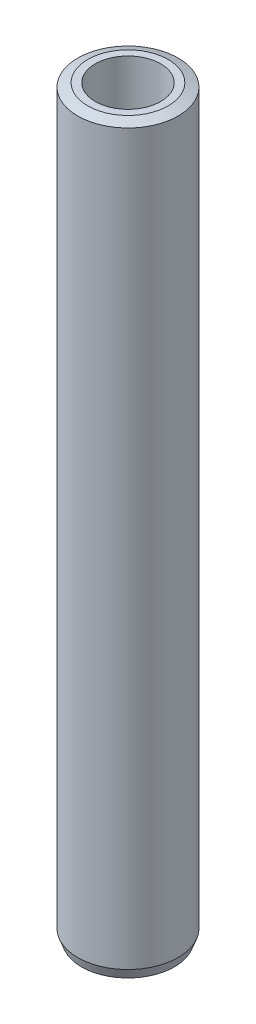
ISO-10303-21;
HEADER;
FILE_DESCRIPTION(('STEP AP214'),'2;1');
FILE_NAME('part.step','',(''),(''),'','','');
FILE_SCHEMA(('AUTOMOTIVE_DESIGN { 1 0 10303 214 1 1 1 1 }'));
ENDSEC;
DATA;
#1=APPLICATION_CONTEXT('core data for automotive mechanical design processes');
#2=APPLICATION_PROTOCOL_DEFINITION('international standard','automotive_design',2000,#1);
#3=PRODUCT_CONTEXT('',#1,'mechanical');
#4=PRODUCT('Part','Part','',(#3));
#5=PRODUCT_RELATED_PRODUCT_CATEGORY('part','',(#4));
#6=PRODUCT_DEFINITION_FORMATION('','',#4);
#7=PRODUCT_DEFINITION_CONTEXT('part definition',#1,'design');
#8=PRODUCT_DEFINITION('design','',#6,#7);
#9=PRODUCT_DEFINITION_SHAPE('','',#8);
#10=(LENGTH_UNIT() NAMED_UNIT(*) SI_UNIT(.MILLI.,.METRE.));
#11=(NAMED_UNIT(*) PLANE_ANGLE_UNIT() SI_UNIT($,.RADIAN.));
#12=(NAMED_UNIT(*) SI_UNIT($,.STERADIAN.) SOLID_ANGLE_UNIT());
#13=UNCERTAINTY_MEASURE_WITH_UNIT(LENGTH_MEASURE(1.E-05),#10,'distance_accuracy_value','');
#14=(GEOMETRIC_REPRESENTATION_CONTEXT(3) GLOBAL_UNCERTAINTY_ASSIGNED_CONTEXT((#13)) GLOBAL_UNIT_ASSIGNED_CONTEXT((#10,
#11,#12)) REPRESENTATION_CONTEXT('',''));
#15=CARTESIAN_POINT('',(0.,0.,0.));
#16=DIRECTION('',(0.,0.,1.));
#17=DIRECTION('',(1.,0.,0.));
#18=AXIS2_PLACEMENT_3D('',#15,#16,#17);
#19=CARTESIAN_POINT('',(0.,184.789062151889,0.));
#20=DIRECTION('',(0.,-1.,0.));
#21=DIRECTION('',(0.,0.,-1.));
#22=AXIS2_PLACEMENT_3D('',#19,#20,#21);
#23=CYLINDRICAL_SURFACE('',#22,12.5);
#24=CARTESIAN_POINT('',(0.,183.853214608277,0.));
#25=DIRECTION('',(0.,1.,0.));
#26=DIRECTION('',(0.,0.,1.));
#27=AXIS2_PLACEMENT_3D('',#24,#25,#26);
#28=CIRCLE('',#27,12.5);
#29=CARTESIAN_POINT('',(0.,183.853214608277,12.5));
#30=VERTEX_POINT('',#29);
#31=EDGE_CURVE('E50',#30,#30,#28,.F.);
#32=ORIENTED_EDGE('',*,*,#31,.T.);
#33=EDGE_LOOP('',(#32));
#34=FACE_BOUND('',#33,.T.);
#35=CARTESIAN_POINT('',(0.,2.49135703973449,0.));
#36=DIRECTION('',(0.,1.,0.));
#37=DIRECTION('',(0.,0.,1.));
#38=AXIS2_PLACEMENT_3D('',#35,#36,#37);
#39=CIRCLE('',#38,12.5);
#40=CARTESIAN_POINT('',(0.,2.49135703973449,12.5));
#41=VERTEX_POINT('',#40);
#42=EDGE_CURVE('E51',#41,#41,#39,.T.);
#43=ORIENTED_EDGE('',*,*,#42,.T.);
#44=EDGE_LOOP('',(#43));
#45=FACE_BOUND('',#44,.T.);
#46=ADVANCED_FACE('F39',(#34,#45),#23,.T.);
#47=CARTESIAN_POINT('',(0.,184.789062151889,0.));
#48=DIRECTION('',(0.,1.,0.));
#49=DIRECTION('',(0.,0.,1.));
#50=AXIS2_PLACEMENT_3D('',#47,#48,#49);
#51=PLANE('',#50);
#52=CARTESIAN_POINT('',(0.,184.789062151889,0.));
#53=DIRECTION('',(0.,1.,0.));
#54=DIRECTION('',(0.,0.,1.));
#55=AXIS2_PLACEMENT_3D('',#52,#53,#54);
#56=CIRCLE('',#55,10.0086429602656);
#57=CARTESIAN_POINT('',(0.,184.789062151889,10.0086429602656));
#58=VERTEX_POINT('',#57);
#59=EDGE_CURVE('E54',#58,#58,#56,.T.);
#60=ORIENTED_EDGE('',*,*,#59,.T.);
#61=EDGE_LOOP('',(#60));
#62=FACE_BOUND('',#61,.T.);
#63=CARTESIAN_POINT('',(0.,184.789062151889,0.));
#64=DIRECTION('',(0.,1.,0.));
#65=DIRECTION('',(0.,0.,1.));
#66=AXIS2_PLACEMENT_3D('',#63,#64,#65);
#67=CIRCLE('',#66,8.13970595904328);
#68=CARTESIAN_POINT('',(0.,184.789062151889,8.13970595904328));
#69=VERTEX_POINT('',#68);
#70=EDGE_CURVE('E58',#69,#69,#67,.T.);
#71=ORIENTED_EDGE('',*,*,#70,.F.);
#72=EDGE_LOOP('',(#71));
#73=FACE_BOUND('',#72,.T.);
#74=ADVANCED_FACE('F69',(#62,#73),#51,.T.);
#75=CARTESIAN_POINT('',(0.,0.,0.));
#76=DIRECTION('',(0.,1.,0.));
#77=DIRECTION('',(0.,0.,1.));
#78=AXIS2_PLACEMENT_3D('',#75,#76,#77);
#79=PLANE('',#78);
#80=CARTESIAN_POINT('',(0.,0.,0.));
#81=DIRECTION('',(0.,1.,0.));
#82=DIRECTION('',(0.,0.,1.));
#83=AXIS2_PLACEMENT_3D('',#80,#81,#82);
#84=CIRCLE('',#83,11.5641524563883);
#85=CARTESIAN_POINT('',(0.,0.,11.5641524563883));
#86=VERTEX_POINT('',#85);
#87=EDGE_CURVE('E10',#86,#86,#84,.F.);
#88=ORIENTED_EDGE('',*,*,#87,.T.);
#89=EDGE_LOOP('',(#88));
#90=FACE_BOUND('',#89,.T.);
#91=CARTESIAN_POINT('',(0.,0.,0.));
#92=DIRECTION('',(0.,1.,0.));
#93=DIRECTION('',(0.,0.,1.));
#94=AXIS2_PLACEMENT_3D('',#91,#92,#93);
#95=CIRCLE('',#94,8.13970595904328);
#96=CARTESIAN_POINT('',(0.,0.,8.13970595904328));
#97=VERTEX_POINT('',#96);
#98=EDGE_CURVE('E63',#97,#97,#95,.T.);
#99=ORIENTED_EDGE('',*,*,#98,.T.);
#100=EDGE_LOOP('',(#99));
#101=FACE_BOUND('',#100,.T.);
#102=ADVANCED_FACE('F75',(#90,#101),#79,.F.);
#103=CARTESIAN_POINT('',(0.,184.789062151889,0.));
#104=DIRECTION('',(0.,-1.,0.));
#105=DIRECTION('',(0.,0.,-1.));
#106=AXIS2_PLACEMENT_3D('',#103,#104,#105);
#107=CYLINDRICAL_SURFACE('',#106,8.13970595904328);
#108=ORIENTED_EDGE('',*,*,#70,.T.);
#109=EDGE_LOOP('',(#108));
#110=FACE_BOUND('',#109,.T.);
#111=ORIENTED_EDGE('',*,*,#98,.F.);
#112=EDGE_LOOP('',(#111));
#113=FACE_BOUND('',#112,.T.);
#114=ADVANCED_FACE('F70',(#110,#113),#107,.F.);
#115=CARTESIAN_POINT('',(0.,184.789062151889,0.));
#116=DIRECTION('',(0.,-1.,0.));
#117=DIRECTION('',(0.,0.,-1.));
#118=AXIS2_PLACEMENT_3D('',#115,#116,#117);
#119=CONICAL_SURFACE('',#118,10.0086429602656,1.21146672410365);
#120=ORIENTED_EDGE('',*,*,#31,.F.);
#121=EDGE_LOOP('',(#120));
#122=FACE_BOUND('',#121,.T.);
#123=ORIENTED_EDGE('',*,*,#59,.F.);
#124=EDGE_LOOP('',(#123));
#125=FACE_BOUND('',#124,.T.);
#126=ADVANCED_FACE('F81',(#122,#125),#119,.T.);
#127=CARTESIAN_POINT('',(0.,2.49135703973449,0.));
#128=DIRECTION('',(0.,1.,0.));
#129=DIRECTION('',(0.,0.,1.));
#130=AXIS2_PLACEMENT_3D('',#127,#128,#129);
#131=CONICAL_SURFACE('',#130,12.5,0.359329602691235);
#132=ORIENTED_EDGE('',*,*,#87,.F.);
#133=EDGE_LOOP('',(#132));
#134=FACE_BOUND('',#133,.T.);
#135=ORIENTED_EDGE('',*,*,#42,.F.);
#136=EDGE_LOOP('',(#135));
#137=FACE_BOUND('',#136,.T.);
#138=ADVANCED_FACE('F45',(#134,#137),#131,.T.);
#139=CLOSED_SHELL('',(#46,#74,#102,#114,#126,#138));
#140=MANIFOLD_SOLID_BREP('B2',#139);
#141=ADVANCED_BREP_SHAPE_REPRESENTATION('',(#18,#140),#14);
#142=SHAPE_DEFINITION_REPRESENTATION(#9,#141);
ENDSEC;
END-ISO-10303-21;
